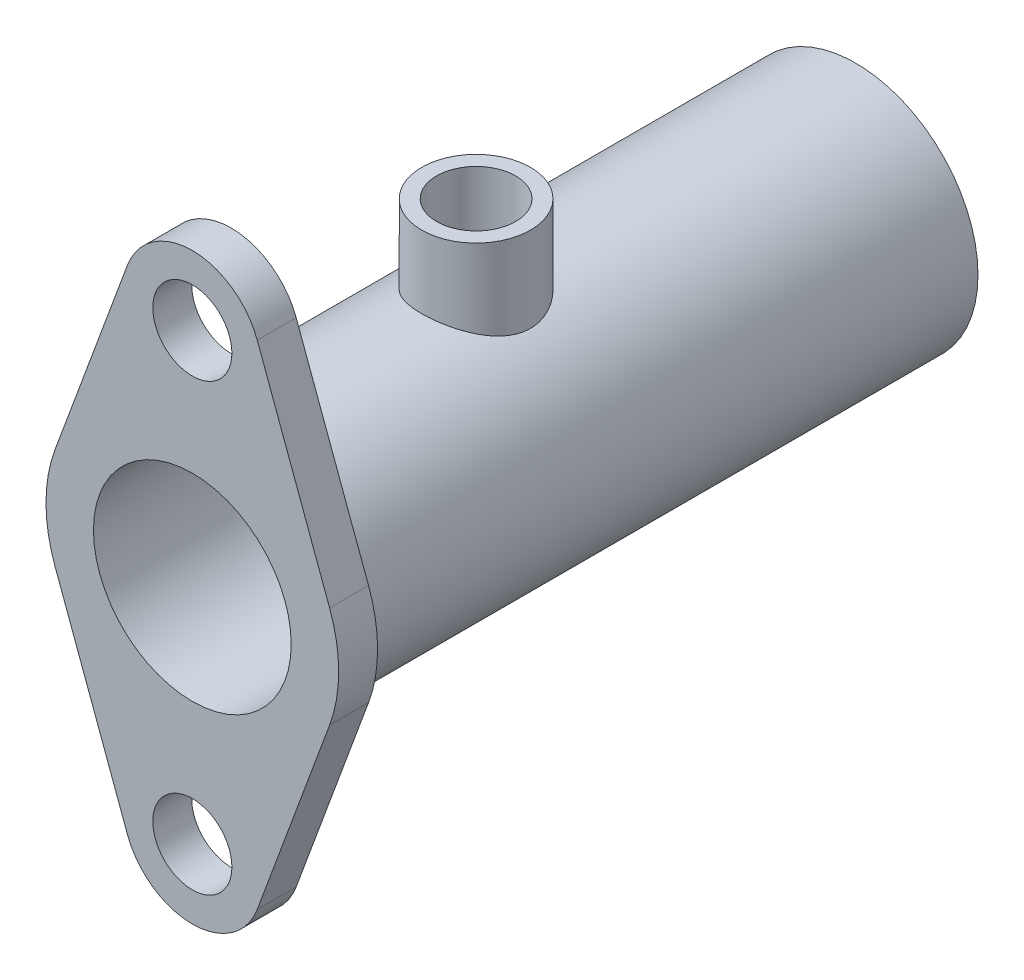
ISO-10303-21;
HEADER;
FILE_DESCRIPTION(('STEP AP214'),'2;1');
FILE_NAME('part.step','',(''),(''),'','','');
FILE_SCHEMA(('AUTOMOTIVE_DESIGN { 1 0 10303 214 1 1 1 1 }'));
ENDSEC;
DATA;
#1=APPLICATION_CONTEXT('core data for automotive mechanical design processes');
#2=APPLICATION_PROTOCOL_DEFINITION('international standard','automotive_design',2000,#1);
#3=PRODUCT_CONTEXT('',#1,'mechanical');
#4=PRODUCT('Part','Part','',(#3));
#5=PRODUCT_RELATED_PRODUCT_CATEGORY('part','',(#4));
#6=PRODUCT_DEFINITION_FORMATION('','',#4);
#7=PRODUCT_DEFINITION_CONTEXT('part definition',#1,'design');
#8=PRODUCT_DEFINITION('design','',#6,#7);
#9=PRODUCT_DEFINITION_SHAPE('','',#8);
#10=(LENGTH_UNIT() NAMED_UNIT(*) SI_UNIT(.MILLI.,.METRE.));
#11=(NAMED_UNIT(*) PLANE_ANGLE_UNIT() SI_UNIT($,.RADIAN.));
#12=(NAMED_UNIT(*) SI_UNIT($,.STERADIAN.) SOLID_ANGLE_UNIT());
#13=UNCERTAINTY_MEASURE_WITH_UNIT(LENGTH_MEASURE(1.E-05),#10,'distance_accuracy_value','');
#14=(GEOMETRIC_REPRESENTATION_CONTEXT(3) GLOBAL_UNCERTAINTY_ASSIGNED_CONTEXT((#13)) GLOBAL_UNIT_ASSIGNED_CONTEXT((#10,
#11,#12)) REPRESENTATION_CONTEXT('',''));
#15=CARTESIAN_POINT('',(0.,0.,0.));
#16=DIRECTION('',(0.,0.,1.));
#17=DIRECTION('',(1.,0.,0.));
#18=AXIS2_PLACEMENT_3D('',#15,#16,#17);
#19=CARTESIAN_POINT('',(0.,0.,0.));
#20=DIRECTION('',(0.,0.,1.));
#21=DIRECTION('',(1.,0.,0.));
#22=AXIS2_PLACEMENT_3D('',#19,#20,#21);
#23=PLANE('',#22);
#24=CARTESIAN_POINT('',(0.,-28.575,0.));
#25=DIRECTION('',(0.,0.,1.));
#26=DIRECTION('',(1.,0.,0.));
#27=AXIS2_PLACEMENT_3D('',#24,#25,#26);
#28=CIRCLE('',#27,5.08);
#29=CARTESIAN_POINT('',(5.08,-28.575,0.));
#30=VERTEX_POINT('',#29);
#31=EDGE_CURVE('E169',#30,#30,#28,.T.);
#32=ORIENTED_EDGE('',*,*,#31,.T.);
#33=EDGE_LOOP('',(#32));
#34=FACE_BOUND('',#33,.T.);
#35=CARTESIAN_POINT('',(0.,28.575,0.));
#36=DIRECTION('',(0.,0.,1.));
#37=DIRECTION('',(1.,0.,0.));
#38=AXIS2_PLACEMENT_3D('',#35,#36,#37);
#39=CIRCLE('',#38,5.08);
#40=CARTESIAN_POINT('',(5.08,28.575,0.));
#41=VERTEX_POINT('',#40);
#42=EDGE_CURVE('E166',#41,#41,#39,.T.);
#43=ORIENTED_EDGE('',*,*,#42,.T.);
#44=EDGE_LOOP('',(#43));
#45=FACE_BOUND('',#44,.T.);
#46=DIRECTION('',(0.346666666666667,-0.937988391304616,0.));
#47=VECTOR('',#46,1.);
#48=CARTESIAN_POINT('',(17.6304298029616,6.51594666666668,0.));
#49=LINE('',#48,#47);
#50=CARTESIAN_POINT('',(8.33871679869803,31.6568666666667,0.));
#51=VERTEX_POINT('',#50);
#52=CARTESIAN_POINT('',(17.6304298029616,6.51594666666668,0.));
#53=VERTEX_POINT('',#52);
#54=EDGE_CURVE('E149',#51,#53,#49,.T.);
#55=ORIENTED_EDGE('',*,*,#54,.T.);
#56=CARTESIAN_POINT('',(0.,0.,0.));
#57=DIRECTION('',(0.,0.,1.));
#58=DIRECTION('',(1.,0.,0.));
#59=AXIS2_PLACEMENT_3D('',#56,#57,#58);
#60=CIRCLE('',#59,18.796);
#61=CARTESIAN_POINT('',(17.6304298029616,-6.51594666666668,0.));
#62=VERTEX_POINT('',#61);
#63=EDGE_CURVE('E161',#62,#53,#60,.T.);
#64=ORIENTED_EDGE('',*,*,#63,.F.);
#65=DIRECTION('',(0.346666666666667,0.937988391304616,0.));
#66=VECTOR('',#65,1.);
#67=CARTESIAN_POINT('',(17.6304298029616,-6.51594666666668,0.));
#68=LINE('',#67,#66);
#69=CARTESIAN_POINT('',(8.33871679869803,-31.6568666666667,0.));
#70=VERTEX_POINT('',#69);
#71=EDGE_CURVE('E90',#70,#62,#68,.T.);
#72=ORIENTED_EDGE('',*,*,#71,.F.);
#73=CARTESIAN_POINT('',(0.,-28.575,0.));
#74=DIRECTION('',(0.,0.,1.));
#75=DIRECTION('',(1.,0.,0.));
#76=AXIS2_PLACEMENT_3D('',#73,#74,#75);
#77=CIRCLE('',#76,8.89);
#78=CARTESIAN_POINT('',(-8.33871679869803,-31.6568666666667,0.));
#79=VERTEX_POINT('',#78);
#80=EDGE_CURVE('E130',#79,#70,#77,.T.);
#81=ORIENTED_EDGE('',*,*,#80,.F.);
#82=DIRECTION('',(-0.346666666666667,0.937988391304616,0.));
#83=VECTOR('',#82,1.);
#84=CARTESIAN_POINT('',(-17.6304298029616,-6.51594666666668,0.));
#85=LINE('',#84,#83);
#86=CARTESIAN_POINT('',(-17.6304298029616,-6.51594666666667,0.));
#87=VERTEX_POINT('',#86);
#88=EDGE_CURVE('E160',#79,#87,#85,.T.);
#89=ORIENTED_EDGE('',*,*,#88,.T.);
#90=CARTESIAN_POINT('',(-17.6304298029616,6.51594666666667,0.));
#91=VERTEX_POINT('',#90);
#92=EDGE_CURVE('E157',#91,#87,#60,.T.);
#93=ORIENTED_EDGE('',*,*,#92,.F.);
#94=DIRECTION('',(-0.346666666666667,-0.937988391304616,0.));
#95=VECTOR('',#94,1.);
#96=CARTESIAN_POINT('',(-17.6304298029616,6.51594666666668,0.));
#97=LINE('',#96,#95);
#98=CARTESIAN_POINT('',(-8.33871679869803,31.6568666666667,0.));
#99=VERTEX_POINT('',#98);
#100=EDGE_CURVE('E155',#99,#91,#97,.T.);
#101=ORIENTED_EDGE('',*,*,#100,.F.);
#102=CARTESIAN_POINT('',(0.,28.575,0.));
#103=DIRECTION('',(0.,0.,1.));
#104=DIRECTION('',(1.,0.,0.));
#105=AXIS2_PLACEMENT_3D('',#102,#103,#104);
#106=CIRCLE('',#105,8.89);
#107=EDGE_CURVE('E152',#51,#99,#106,.T.);
#108=ORIENTED_EDGE('',*,*,#107,.F.);
#109=EDGE_LOOP('',(#55,#64,#72,#81,#89,#93,#101,#108));
#110=FACE_BOUND('',#109,.T.);
#111=CARTESIAN_POINT('',(0.,0.,0.));
#112=DIRECTION('',(0.,0.,1.));
#113=DIRECTION('',(1.,0.,0.));
#114=AXIS2_PLACEMENT_3D('',#111,#112,#113);
#115=CIRCLE('',#114,15.7);
#116=CARTESIAN_POINT('',(15.7,0.,0.));
#117=VERTEX_POINT('',#116);
#118=EDGE_CURVE('E13',#117,#117,#115,.F.);
#119=ORIENTED_EDGE('',*,*,#118,.F.);
#120=EDGE_LOOP('',(#119));
#121=FACE_BOUND('',#120,.T.);
#122=ADVANCED_FACE('F44',(#34,#45,#110,#121),#23,.F.);
#123=CARTESIAN_POINT('',(17.6304298029616,6.51594666666668,5.));
#124=DIRECTION('',(0.937988391304616,0.346666666666667,0.));
#125=DIRECTION('',(-0.346666666666667,0.937988391304616,0.));
#126=AXIS2_PLACEMENT_3D('',#123,#124,#125);
#127=PLANE('',#126);
#128=ORIENTED_EDGE('',*,*,#54,.F.);
#129=DIRECTION('',(0.,0.,-1.));
#130=VECTOR('',#129,1.);
#131=CARTESIAN_POINT('',(8.33871679869803,31.6568666666667,5.));
#132=LINE('',#131,#130);
#133=CARTESIAN_POINT('',(8.33871679869803,31.6568666666667,5.));
#134=VERTEX_POINT('',#133);
#135=EDGE_CURVE('E53',#134,#51,#132,.T.);
#136=ORIENTED_EDGE('',*,*,#135,.F.);
#137=DIRECTION('',(0.346666666666667,-0.937988391304616,0.));
#138=VECTOR('',#137,1.);
#139=CARTESIAN_POINT('',(17.6304298029616,6.51594666666668,5.));
#140=LINE('',#139,#138);
#141=CARTESIAN_POINT('',(17.6304298029616,6.51594666666668,5.));
#142=VERTEX_POINT('',#141);
#143=EDGE_CURVE('E172',#134,#142,#140,.T.);
#144=ORIENTED_EDGE('',*,*,#143,.T.);
#145=DIRECTION('',(0.,0.,-1.));
#146=VECTOR('',#145,1.);
#147=CARTESIAN_POINT('',(17.6304298029616,6.51594666666668,5.));
#148=LINE('',#147,#146);
#149=EDGE_CURVE('E97',#142,#53,#148,.T.);
#150=ORIENTED_EDGE('',*,*,#149,.T.);
#151=EDGE_LOOP('',(#128,#136,#144,#150));
#152=FACE_BOUND('',#151,.T.);
#153=ADVANCED_FACE('F46',(#152),#127,.T.);
#154=CARTESIAN_POINT('',(0.,28.575,5.));
#155=DIRECTION('',(0.,0.,-1.));
#156=DIRECTION('',(-1.,0.,0.));
#157=AXIS2_PLACEMENT_3D('',#154,#155,#156);
#158=CYLINDRICAL_SURFACE('',#157,8.89);
#159=ORIENTED_EDGE('',*,*,#107,.T.);
#160=DIRECTION('',(0.,0.,-1.));
#161=VECTOR('',#160,1.);
#162=CARTESIAN_POINT('',(-8.33871679869803,31.6568666666667,5.));
#163=LINE('',#162,#161);
#164=CARTESIAN_POINT('',(-8.33871679869803,31.6568666666667,5.));
#165=VERTEX_POINT('',#164);
#166=EDGE_CURVE('E181',#165,#99,#163,.T.);
#167=ORIENTED_EDGE('',*,*,#166,.F.);
#168=CARTESIAN_POINT('',(0.,28.575,5.));
#169=DIRECTION('',(0.,0.,1.));
#170=DIRECTION('',(1.,0.,0.));
#171=AXIS2_PLACEMENT_3D('',#168,#169,#170);
#172=CIRCLE('',#171,8.89);
#173=EDGE_CURVE('E187',#134,#165,#172,.T.);
#174=ORIENTED_EDGE('',*,*,#173,.F.);
#175=ORIENTED_EDGE('',*,*,#135,.T.);
#176=EDGE_LOOP('',(#159,#167,#174,#175));
#177=FACE_BOUND('',#176,.T.);
#178=ADVANCED_FACE('F185',(#177),#158,.T.);
#179=CARTESIAN_POINT('',(-17.6304298029616,6.51594666666668,5.));
#180=DIRECTION('',(0.937988391304616,-0.346666666666667,0.));
#181=DIRECTION('',(0.346666666666667,0.937988391304616,0.));
#182=AXIS2_PLACEMENT_3D('',#179,#180,#181);
#183=PLANE('',#182);
#184=ORIENTED_EDGE('',*,*,#100,.T.);
#185=DIRECTION('',(0.,0.,-1.));
#186=VECTOR('',#185,1.);
#187=CARTESIAN_POINT('',(-17.6304298029616,6.51594666666667,5.));
#188=LINE('',#187,#186);
#189=CARTESIAN_POINT('',(-17.6304298029616,6.51594666666667,5.));
#190=VERTEX_POINT('',#189);
#191=EDGE_CURVE('E178',#190,#91,#188,.T.);
#192=ORIENTED_EDGE('',*,*,#191,.F.);
#193=DIRECTION('',(-0.346666666666667,-0.937988391304616,0.));
#194=VECTOR('',#193,1.);
#195=CARTESIAN_POINT('',(-17.6304298029616,6.51594666666668,5.));
#196=LINE('',#195,#194);
#197=EDGE_CURVE('E243',#165,#190,#196,.T.);
#198=ORIENTED_EDGE('',*,*,#197,.F.);
#199=ORIENTED_EDGE('',*,*,#166,.T.);
#200=EDGE_LOOP('',(#184,#192,#198,#199));
#201=FACE_BOUND('',#200,.T.);
#202=ADVANCED_FACE('F198',(#201),#183,.F.);
#203=CARTESIAN_POINT('',(0.,0.,5.));
#204=DIRECTION('',(0.,0.,-1.));
#205=DIRECTION('',(-1.,0.,0.));
#206=AXIS2_PLACEMENT_3D('',#203,#204,#205);
#207=CYLINDRICAL_SURFACE('',#206,18.796);
#208=ORIENTED_EDGE('',*,*,#92,.T.);
#209=DIRECTION('',(0.,0.,-1.));
#210=VECTOR('',#209,1.);
#211=CARTESIAN_POINT('',(-17.6304298029616,-6.51594666666667,5.));
#212=LINE('',#211,#210);
#213=CARTESIAN_POINT('',(-17.6304298029616,-6.51594666666667,5.));
#214=VERTEX_POINT('',#213);
#215=EDGE_CURVE('E176',#214,#87,#212,.T.);
#216=ORIENTED_EDGE('',*,*,#215,.F.);
#217=CARTESIAN_POINT('',(0.,0.,5.));
#218=DIRECTION('',(0.,0.,1.));
#219=DIRECTION('',(1.,0.,0.));
#220=AXIS2_PLACEMENT_3D('',#217,#218,#219);
#221=CIRCLE('',#220,18.796);
#222=EDGE_CURVE('E138',#190,#214,#221,.T.);
#223=ORIENTED_EDGE('',*,*,#222,.F.);
#224=ORIENTED_EDGE('',*,*,#191,.T.);
#225=EDGE_LOOP('',(#208,#216,#223,#224));
#226=FACE_BOUND('',#225,.T.);
#227=ADVANCED_FACE('F223',(#226),#207,.T.);
#228=CARTESIAN_POINT('',(-17.6304298029616,-6.51594666666668,5.));
#229=DIRECTION('',(-0.937988391304616,-0.346666666666667,0.));
#230=DIRECTION('',(0.346666666666667,-0.937988391304616,0.));
#231=AXIS2_PLACEMENT_3D('',#228,#229,#230);
#232=PLANE('',#231);
#233=ORIENTED_EDGE('',*,*,#88,.F.);
#234=DIRECTION('',(0.,0.,-1.));
#235=VECTOR('',#234,1.);
#236=CARTESIAN_POINT('',(-8.33871679869803,-31.6568666666667,5.));
#237=LINE('',#236,#235);
#238=CARTESIAN_POINT('',(-8.33871679869803,-31.6568666666667,5.));
#239=VERTEX_POINT('',#238);
#240=EDGE_CURVE('E131',#239,#79,#237,.T.);
#241=ORIENTED_EDGE('',*,*,#240,.F.);
#242=DIRECTION('',(-0.346666666666667,0.937988391304616,0.));
#243=VECTOR('',#242,1.);
#244=CARTESIAN_POINT('',(-17.6304298029616,-6.51594666666668,5.));
#245=LINE('',#244,#243);
#246=EDGE_CURVE('E124',#239,#214,#245,.T.);
#247=ORIENTED_EDGE('',*,*,#246,.T.);
#248=ORIENTED_EDGE('',*,*,#215,.T.);
#249=EDGE_LOOP('',(#233,#241,#247,#248));
#250=FACE_BOUND('',#249,.T.);
#251=ADVANCED_FACE('F228',(#250),#232,.T.);
#252=CARTESIAN_POINT('',(0.,-28.575,5.));
#253=DIRECTION('',(0.,0.,-1.));
#254=DIRECTION('',(-1.,0.,0.));
#255=AXIS2_PLACEMENT_3D('',#252,#253,#254);
#256=CYLINDRICAL_SURFACE('',#255,8.89);
#257=ORIENTED_EDGE('',*,*,#80,.T.);
#258=DIRECTION('',(0.,0.,-1.));
#259=VECTOR('',#258,1.);
#260=CARTESIAN_POINT('',(8.33871679869803,-31.6568666666667,5.));
#261=LINE('',#260,#259);
#262=CARTESIAN_POINT('',(8.33871679869803,-31.6568666666667,5.));
#263=VERTEX_POINT('',#262);
#264=EDGE_CURVE('E127',#263,#70,#261,.T.);
#265=ORIENTED_EDGE('',*,*,#264,.F.);
#266=CARTESIAN_POINT('',(0.,-28.575,5.));
#267=DIRECTION('',(0.,0.,1.));
#268=DIRECTION('',(1.,0.,0.));
#269=AXIS2_PLACEMENT_3D('',#266,#267,#268);
#270=CIRCLE('',#269,8.89);
#271=EDGE_CURVE('E117',#239,#263,#270,.T.);
#272=ORIENTED_EDGE('',*,*,#271,.F.);
#273=ORIENTED_EDGE('',*,*,#240,.T.);
#274=EDGE_LOOP('',(#257,#265,#272,#273));
#275=FACE_BOUND('',#274,.T.);
#276=ADVANCED_FACE('F128',(#275),#256,.T.);
#277=CARTESIAN_POINT('',(17.6304298029616,-6.51594666666668,5.));
#278=DIRECTION('',(-0.937988391304616,0.346666666666667,0.));
#279=DIRECTION('',(-0.346666666666667,-0.937988391304616,0.));
#280=AXIS2_PLACEMENT_3D('',#277,#278,#279);
#281=PLANE('',#280);
#282=ORIENTED_EDGE('',*,*,#71,.T.);
#283=DIRECTION('',(0.,0.,-1.));
#284=VECTOR('',#283,1.);
#285=CARTESIAN_POINT('',(17.6304298029616,-6.51594666666668,5.));
#286=LINE('',#285,#284);
#287=CARTESIAN_POINT('',(17.6304298029616,-6.51594666666668,5.));
#288=VERTEX_POINT('',#287);
#289=EDGE_CURVE('E132',#288,#62,#286,.T.);
#290=ORIENTED_EDGE('',*,*,#289,.F.);
#291=DIRECTION('',(0.346666666666667,0.937988391304616,0.));
#292=VECTOR('',#291,1.);
#293=CARTESIAN_POINT('',(17.6304298029616,-6.51594666666668,5.));
#294=LINE('',#293,#292);
#295=EDGE_CURVE('E122',#263,#288,#294,.T.);
#296=ORIENTED_EDGE('',*,*,#295,.F.);
#297=ORIENTED_EDGE('',*,*,#264,.T.);
#298=EDGE_LOOP('',(#282,#290,#296,#297));
#299=FACE_BOUND('',#298,.T.);
#300=ADVANCED_FACE('F134',(#299),#281,.F.);
#301=CARTESIAN_POINT('',(0.,0.,5.));
#302=DIRECTION('',(0.,0.,-1.));
#303=DIRECTION('',(-1.,0.,0.));
#304=AXIS2_PLACEMENT_3D('',#301,#302,#303);
#305=CYLINDRICAL_SURFACE('',#304,12.7);
#306=CARTESIAN_POINT('',(0.,12.7,-26.368));
#307=CARTESIAN_POINT('',(0.13657888953433,12.6999993890941,-26.3680007849277));
#308=CARTESIAN_POINT('',(0.27321049045083,12.6977906501342,-26.3735156334634));
#309=CARTESIAN_POINT('',(0.545506981528575,12.6890110729112,-26.3955252117852));
#310=CARTESIAN_POINT('',(0.681171164826471,12.6824373212499,-26.4120272749339));
#311=CARTESIAN_POINT('',(0.950764736195462,12.6650829778938,-26.4558928846592));
#312=CARTESIAN_POINT('',(1.08468976587268,12.6542933692188,-26.4832797140166));
#313=CARTESIAN_POINT('',(1.34959558749273,12.6287890145993,-26.5486514081971));
#314=CARTESIAN_POINT('',(1.48057515260813,12.6140726647821,-26.5866406038356));
#315=CARTESIAN_POINT('',(1.73818399513655,12.5811568408139,-26.6727007503007));
#316=CARTESIAN_POINT('',(1.86482760981798,12.5629704921612,-26.7207337733429));
#317=CARTESIAN_POINT('',(2.11349766338329,12.5235383930419,-26.8265482374987));
#318=CARTESIAN_POINT('',(2.2355223567497,12.5022915002698,-26.8843333198205));
#319=CARTESIAN_POINT('',(2.59337709200364,12.434753871576,-27.0715729524004));
#320=CARTESIAN_POINT('',(2.82134541429832,12.3846183081885,-27.2150323049822));
#321=CARTESIAN_POINT('',(3.26012849529021,12.2766018463711,-27.5420844432643));
#322=CARTESIAN_POINT('',(3.46978650866248,12.2184808209976,-27.7271359157959));
#323=CARTESIAN_POINT('',(3.85617618145696,12.1020921712612,-28.1292710169515));
#324=CARTESIAN_POINT('',(4.03289173184128,12.0438244892236,-28.3463702245927));
#325=CARTESIAN_POINT('',(4.27333224607312,11.9597786559769,-28.6972877548414));
#326=CARTESIAN_POINT('',(4.35073758934107,11.9317639998504,-28.8214163937355));
#327=CARTESIAN_POINT('',(4.49474851386404,11.8782627873434,-29.076286333904));
#328=CARTESIAN_POINT('',(4.56135853651275,11.8527751929674,-29.2070248865447));
#329=CARTESIAN_POINT('',(4.68321059318658,11.8051609312419,-29.4742934400009));
#330=CARTESIAN_POINT('',(4.73845185833348,11.7830344912364,-29.6108238317704));
#331=CARTESIAN_POINT('',(4.83699721851358,11.7429251062006,-29.8886522114903));
#332=CARTESIAN_POINT('',(4.88030729315752,11.7249400863397,-30.0299477712587));
#333=CARTESIAN_POINT('',(4.95287304542164,11.694465704216,-30.3098424561225));
#334=CARTESIAN_POINT('',(4.98267257629154,11.6817657974293,-30.4482776755984));
#335=CARTESIAN_POINT('',(5.03063110741737,11.661193512457,-30.7274463742891));
#336=CARTESIAN_POINT('',(5.04879536472703,11.6533189541504,-30.8681787860691));
#337=CARTESIAN_POINT('',(5.07328409233394,11.6426787163624,-31.1508334912651));
#338=CARTESIAN_POINT('',(5.07961106381311,11.6399119576203,-31.2927555269498));
#339=CARTESIAN_POINT('',(5.08035408591595,11.6395877827342,-31.5766332631531));
#340=CARTESIAN_POINT('',(5.07477069207254,11.6420301236231,-31.7185889617927));
#341=CARTESIAN_POINT('',(5.05256941288101,11.6516811298172,-31.9914627151397));
#342=CARTESIAN_POINT('',(5.0367498788636,11.6585447995602,-32.1224588831577));
#343=CARTESIAN_POINT('',(4.99502856520063,11.6764808325947,-32.3825846999107));
#344=CARTESIAN_POINT('',(4.96912346727406,11.6875545810285,-32.5117137198128));
#345=CARTESIAN_POINT('',(4.90748707801188,11.7135685573434,-32.7671761518565));
#346=CARTESIAN_POINT('',(4.87175815242258,11.7285078542832,-32.8935102291642));
#347=CARTESIAN_POINT('',(4.7907983715432,11.7618093299808,-33.142649231893));
#348=CARTESIAN_POINT('',(4.74556386452582,11.7801728238946,-33.2654527803316));
#349=CARTESIAN_POINT('',(4.59413007330002,11.8404385283878,-33.6322981665486));
#350=CARTESIAN_POINT('',(4.47341172010527,11.8869773468941,-33.8697710990354));
#351=CARTESIAN_POINT('',(4.19735153484334,11.9872318445277,-34.3218369570536));
#352=CARTESIAN_POINT('',(4.0419966989154,12.040950216092,-34.5364212444604));
#353=CARTESIAN_POINT('',(3.68695363290425,12.1545765778349,-34.9542235641871));
#354=CARTESIAN_POINT('',(3.48476666911062,12.2146420372131,-35.1552806664471));
#355=CARTESIAN_POINT('',(3.04875312345319,12.3306858083655,-35.5213824852269));
#356=CARTESIAN_POINT('',(2.81492025526182,12.3866633046728,-35.6864200295496));
#357=CARTESIAN_POINT('',(2.44243576268607,12.4635923108057,-35.9047091173866));
#358=CARTESIAN_POINT('',(2.31322457349337,12.4882758300032,-35.9731341407114));
#359=CARTESIAN_POINT('',(2.04891683873549,12.5343483795847,-36.0987757501476));
#360=CARTESIAN_POINT('',(1.91382268754219,12.5557387345071,-36.1559968451037));
#361=CARTESIAN_POINT('',(1.63872263318651,12.5945976802382,-36.2586701700953));
#362=CARTESIAN_POINT('',(1.49871771000286,12.6120670484165,-36.3041247332222));
#363=CARTESIAN_POINT('',(1.21483842053292,12.6425684296083,-36.3828003061923));
#364=CARTESIAN_POINT('',(1.07096432289598,12.6556007498465,-36.4160221630511));
#365=CARTESIAN_POINT('',(0.789130156096128,12.6761998613456,-36.4682571984717));
#366=CARTESIAN_POINT('',(0.651324362804275,12.6840445945558,-36.4879952474239));
#367=CARTESIAN_POINT('',(0.37437855418075,12.6952369856342,-36.5160972297143));
#368=CARTESIAN_POINT('',(0.235238604913056,12.6985848650286,-36.5244617233426));
#369=CARTESIAN_POINT('',(-0.0432612075818106,12.7006896261756,-36.5297243686465));
#370=CARTESIAN_POINT('',(-0.182621015517081,12.6994475206655,-36.526625049705));
#371=CARTESIAN_POINT('',(-0.46049828676147,12.6924093937686,-36.5090000697498));
#372=CARTESIAN_POINT('',(-0.599015766169488,12.6866134596937,-36.4944746278126));
#373=CARTESIAN_POINT('',(-0.86791805955898,12.6709917787818,-36.4550692431393));
#374=CARTESIAN_POINT('',(-0.998387516609907,12.661359975826,-36.4306868846493));
#375=CARTESIAN_POINT('',(-1.25674613919475,12.6383311724186,-36.3718751929015));
#376=CARTESIAN_POINT('',(-1.38463444577234,12.6249329400146,-36.3374425721861));
#377=CARTESIAN_POINT('',(-1.63692767163367,12.59470548678,-36.2588544527936));
#378=CARTESIAN_POINT('',(-1.76133354706088,12.5778772184271,-36.2147016530158));
#379=CARTESIAN_POINT('',(-2.00599351119806,12.5411842059523,-36.1170201975302));
#380=CARTESIAN_POINT('',(-2.12624599962982,12.5213183070992,-36.0634879751756));
#381=CARTESIAN_POINT('',(-2.36544129119948,12.4783768512687,-35.9457090894106));
#382=CARTESIAN_POINT('',(-2.48423481013956,12.4552224678383,-35.8811876240042));
#383=CARTESIAN_POINT('',(-2.7160023907027,12.4067471458591,-35.7431073450562));
#384=CARTESIAN_POINT('',(-2.82897443924562,12.3814254658015,-35.6695454346768));
#385=CARTESIAN_POINT('',(-3.15821588246475,12.3031070234228,-35.4360329342036));
#386=CARTESIAN_POINT('',(-3.36495054910833,12.2477306510789,-35.2631862819227));
#387=CARTESIAN_POINT('',(-3.76109653179748,12.1321717181693,-34.8747309059985));
#388=CARTESIAN_POINT('',(-3.94846303887086,12.0719132209575,-34.6570523892458));
#389=CARTESIAN_POINT('',(-4.20038862869192,11.985601759733,-34.3087247660481));
#390=CARTESIAN_POINT('',(-4.2795508752071,11.957494069914,-34.1888973871397));
#391=CARTESIAN_POINT('',(-4.42762490615593,11.9034591784386,-33.942624548082));
#392=CARTESIAN_POINT('',(-4.49654099782848,11.8775310625448,-33.8161818992267));
#393=CARTESIAN_POINT('',(-4.62422692960089,11.8284089743566,-33.5561106185014));
#394=CARTESIAN_POINT('',(-4.68288588431906,11.8052456510456,-33.4224217555981));
#395=CARTESIAN_POINT('',(-4.78862218047476,11.7627524604073,-33.1500078965004));
#396=CARTESIAN_POINT('',(-4.83570455179987,11.7434209289223,-33.0112851176555));
#397=CARTESIAN_POINT('',(-4.9178049053994,11.709277279721,-32.7298252970664));
#398=CARTESIAN_POINT('',(-4.95282763062865,11.6944633855197,-32.5870898574119));
#399=CARTESIAN_POINT('',(-5.01042132280195,11.6699041491565,-32.2987016625336));
#400=CARTESIAN_POINT('',(-5.03299333215922,11.660158382679,-32.1530491525945));
#401=CARTESIAN_POINT('',(-5.06423356634903,11.6466219845978,-31.8706571953484));
#402=CARTESIAN_POINT('',(-5.07378780098628,11.6424522719262,-31.73403328421));
#403=CARTESIAN_POINT('',(-5.08182977776097,11.638944413022,-31.4603483423086));
#404=CARTESIAN_POINT('',(-5.08031380476877,11.6396078887934,-31.3232871802316));
#405=CARTESIAN_POINT('',(-5.06622654956677,11.6457462815635,-31.0499137743123));
#406=CARTESIAN_POINT('',(-5.0536608067671,11.6512187877246,-30.9136011896469));
#407=CARTESIAN_POINT('',(-5.01761817189203,11.6667858383301,-30.642645199244));
#408=CARTESIAN_POINT('',(-4.99413716774656,11.6768821246546,-30.5080024422184));
#409=CARTESIAN_POINT('',(-4.93766539459624,11.7008701114516,-30.246753056526));
#410=CARTESIAN_POINT('',(-4.90509278168097,11.7145937621218,-30.1200404582239));
#411=CARTESIAN_POINT('',(-4.83042520165497,11.7455786497197,-29.8698814951904));
#412=CARTESIAN_POINT('',(-4.78832692724271,11.7628411151246,-29.7464362815591));
#413=CARTESIAN_POINT('',(-4.64825084755525,11.8192196106272,-29.3821525345446));
#414=CARTESIAN_POINT('',(-4.53645102298801,11.8629449839448,-29.1471793379407));
#415=CARTESIAN_POINT('',(-4.27195397524239,11.9608258413198,-28.6854386958209));
#416=CARTESIAN_POINT('',(-4.11728162482376,12.0154351717205,-28.4599113964448));
#417=CARTESIAN_POINT('',(-3.77413630047471,12.1275870720341,-28.0367821512535));
#418=CARTESIAN_POINT('',(-3.58565313873735,12.1851305222992,-27.8391886545734));
#419=CARTESIAN_POINT('',(-3.27427857533985,12.2711761427216,-27.5612783039482));
#420=CARTESIAN_POINT('',(-3.161862586924,12.3006908493337,-27.469286628523));
#421=CARTESIAN_POINT('',(-2.92931746253446,12.3581316209862,-27.2951006393999));
#422=CARTESIAN_POINT('',(-2.80919113027475,12.3860582566084,-27.2129027950782));
#423=CARTESIAN_POINT('',(-2.5618316639536,12.4395759585663,-27.0588456909704));
#424=CARTESIAN_POINT('',(-2.43459197538871,12.4651648116434,-26.9869961919735));
#425=CARTESIAN_POINT('',(-2.173979065224,12.5132473271103,-26.8543545617671));
#426=CARTESIAN_POINT('',(-2.04060868857344,12.5357424062024,-26.7935573653503));
#427=CARTESIAN_POINT('',(-1.77107599138872,12.5766263814249,-26.6845518440859));
#428=CARTESIAN_POINT('',(-1.63500812768193,12.5950823287861,-26.6361352662267));
#429=CARTESIAN_POINT('',(-1.35884261395213,12.6278607537935,-26.5509792289659));
#430=CARTESIAN_POINT('',(-1.21874689081949,12.6421851728988,-26.5142342840872));
#431=CARTESIAN_POINT('',(-0.935917858309417,12.6662604532646,-26.4528674921762));
#432=CARTESIAN_POINT('',(-0.793192120404746,12.6760227961443,-26.4282152030541));
#433=CARTESIAN_POINT('',(-0.505983414523336,12.6907299121793,-26.3911909795778));
#434=CARTESIAN_POINT('',(-0.36150186108248,12.6956783327828,-26.3788097474647));
#435=CARTESIAN_POINT('',(-0.180670557752245,12.6987663598475,-26.3710849206923));
#436=CARTESIAN_POINT('',(-0.144548710117646,12.6992287733608,-26.3699283332516));
#437=CARTESIAN_POINT('',(-0.0722858055529835,12.6998456742016,-26.3683857692217));
#438=CARTESIAN_POINT('',(-0.0361447486318708,12.7000001616724,-26.3679997922738));
#439=CARTESIAN_POINT('',(0.,12.7,-26.368));
#440=B_SPLINE_CURVE_WITH_KNOTS('',3,(#306,#307,#308,#309,#310,#311,#312,#313,#314,#315,#316,
#317,#318,#319,#320,#321,#322,#323,#324,#325,#326,#327,#328,#329,#330,#331,#332,#333,#334,#335,
#336,#337,#338,#339,#340,#341,#342,#343,#344,#345,#346,#347,#348,#349,#350,#351,#352,#353,#354,
#355,#356,#357,#358,#359,#360,#361,#362,#363,#364,#365,#366,#367,#368,#369,#370,#371,#372,#373,
#374,#375,#376,#377,#378,#379,#380,#381,#382,#383,#384,#385,#386,#387,#388,#389,#390,#391,#392,
#393,#394,#395,#396,#397,#398,#399,#400,#401,#402,#403,#404,#405,#406,#407,#408,#409,#410,#411,
#412,#413,#414,#415,#416,#417,#418,#419,#420,#421,#422,#423,#424,#425,#426,#427,#428,#429,#430,
#431,#432,#433,#434,#435,#436,#437,#438,#439),.UNSPECIFIED.,.T.,.F.,(4,2,2,2,2,2,2,2,2,2,2,2,2,
2,2,2,2,2,2,2,2,2,2,2,2,2,2,2,2,2,2,2,2,2,2,2,2,2,2,2,2,2,2,2,2,2,2,2,2,2,2,2,2,2,2,2,2,2,2,2,2,
2,2,2,2,2,4),(0.,0.409699505849388,0.81967273811972,1.23052767394621,1.64155068053326,
2.05104872888448,2.46070001461612,3.2788748532651,4.13217840782839,4.98589814397235,
5.43226743317487,5.87845260906245,6.32466795090346,6.77065925237037,7.19662008757566,
7.62238832899001,8.04806659672581,8.47372501006495,8.86963855200047,9.26568246484387,
9.66163108692252,10.0577320982475,10.8652829099338,11.6731374191737,12.5434411712824,
13.4139180600731,13.8582776241643,14.3024579935235,14.7465502223361,15.1906116955894,
15.6083783642092,16.0261244518428,16.4437783732157,16.8614242869822,17.2601967308736,
17.6590997603512,18.0578921700232,18.4568365560964,18.8678316973273,19.2789680209496,
20.1007709519075,20.9768300360938,21.4154180400381,21.8538211475581,22.296704450852,
22.7393949852361,23.181911213857,23.6243903879972,24.0349300132417,24.4456074207264,
24.8560790669549,25.2667054742761,25.6608997623927,26.0552311250107,26.8433249833231,
27.6765423225119,28.5100111481212,28.9542450447566,29.3983183097817,29.842807729363,
30.2870929255824,30.7233232046688,31.1593481582451,31.594269754901,32.0288615596941,
32.1372860211734,32.2457104321788),.UNSPECIFIED.);
#441=CARTESIAN_POINT('',(0.,12.7,-26.368));
#442=VERTEX_POINT('',#441);
#443=EDGE_CURVE('E289',#442,#442,#440,.T.);
#444=ORIENTED_EDGE('',*,*,#443,.T.);
#445=EDGE_LOOP('',(#444));
#446=FACE_BOUND('',#445,.T.);
#447=CARTESIAN_POINT('',(0.,0.,5.));
#448=DIRECTION('',(0.,0.,1.));
#449=DIRECTION('',(1.,0.,0.));
#450=AXIS2_PLACEMENT_3D('',#447,#448,#449);
#451=CIRCLE('',#450,12.7);
#452=CARTESIAN_POINT('',(12.7,0.,5.));
#453=VERTEX_POINT('',#452);
#454=EDGE_CURVE('E143',#453,#453,#451,.T.);
#455=ORIENTED_EDGE('',*,*,#454,.T.);
#456=EDGE_LOOP('',(#455));
#457=FACE_BOUND('',#456,.T.);
#458=CARTESIAN_POINT('',(0.,0.,-77.216));
#459=DIRECTION('',(0.,0.,-1.));
#460=DIRECTION('',(-1.,0.,0.));
#461=AXIS2_PLACEMENT_3D('',#458,#459,#460);
#462=CIRCLE('',#461,12.7);
#463=CARTESIAN_POINT('',(-12.7,0.,-77.216));
#464=VERTEX_POINT('',#463);
#465=EDGE_CURVE('E153',#464,#464,#462,.T.);
#466=ORIENTED_EDGE('',*,*,#465,.T.);
#467=EDGE_LOOP('',(#466));
#468=FACE_BOUND('',#467,.T.);
#469=ADVANCED_FACE('F212',(#446,#457,#468),#305,.F.);
#470=CARTESIAN_POINT('',(0.,28.575,5.));
#471=DIRECTION('',(0.,0.,-1.));
#472=DIRECTION('',(-1.,0.,0.));
#473=AXIS2_PLACEMENT_3D('',#470,#471,#472);
#474=CYLINDRICAL_SURFACE('',#473,5.08);
#475=CARTESIAN_POINT('',(0.,28.575,5.));
#476=DIRECTION('',(0.,0.,1.));
#477=DIRECTION('',(1.,0.,0.));
#478=AXIS2_PLACEMENT_3D('',#475,#476,#477);
#479=CIRCLE('',#478,5.08);
#480=CARTESIAN_POINT('',(5.08,28.575,5.));
#481=VERTEX_POINT('',#480);
#482=EDGE_CURVE('E136',#481,#481,#479,.T.);
#483=ORIENTED_EDGE('',*,*,#482,.T.);
#484=EDGE_LOOP('',(#483));
#485=FACE_BOUND('',#484,.T.);
#486=ORIENTED_EDGE('',*,*,#42,.F.);
#487=EDGE_LOOP('',(#486));
#488=FACE_BOUND('',#487,.T.);
#489=ADVANCED_FACE('F215',(#485,#488),#474,.F.);
#490=ORIENTED_EDGE('',*,*,#63,.T.);
#491=ORIENTED_EDGE('',*,*,#149,.F.);
#492=EDGE_CURVE('E61',#288,#142,#221,.T.);
#493=ORIENTED_EDGE('',*,*,#492,.F.);
#494=ORIENTED_EDGE('',*,*,#289,.T.);
#495=EDGE_LOOP('',(#490,#491,#493,#494));
#496=FACE_BOUND('',#495,.T.);
#497=ADVANCED_FACE('F210',(#496),#207,.T.);
#498=CARTESIAN_POINT('',(0.,-28.575,5.));
#499=DIRECTION('',(0.,0.,-1.));
#500=DIRECTION('',(-1.,0.,0.));
#501=AXIS2_PLACEMENT_3D('',#498,#499,#500);
#502=CYLINDRICAL_SURFACE('',#501,5.08);
#503=CARTESIAN_POINT('',(0.,-28.575,5.));
#504=DIRECTION('',(0.,0.,1.));
#505=DIRECTION('',(1.,0.,0.));
#506=AXIS2_PLACEMENT_3D('',#503,#504,#505);
#507=CIRCLE('',#506,5.08);
#508=CARTESIAN_POINT('',(5.08,-28.575,5.));
#509=VERTEX_POINT('',#508);
#510=EDGE_CURVE('E146',#509,#509,#507,.T.);
#511=ORIENTED_EDGE('',*,*,#510,.T.);
#512=EDGE_LOOP('',(#511));
#513=FACE_BOUND('',#512,.T.);
#514=ORIENTED_EDGE('',*,*,#31,.F.);
#515=EDGE_LOOP('',(#514));
#516=FACE_BOUND('',#515,.T.);
#517=ADVANCED_FACE('F207',(#513,#516),#502,.F.);
#518=CARTESIAN_POINT('',(0.,0.,5.));
#519=DIRECTION('',(0.,0.,1.));
#520=DIRECTION('',(1.,0.,0.));
#521=AXIS2_PLACEMENT_3D('',#518,#519,#520);
#522=PLANE('',#521);
#523=ORIENTED_EDGE('',*,*,#143,.F.);
#524=ORIENTED_EDGE('',*,*,#173,.T.);
#525=ORIENTED_EDGE('',*,*,#197,.T.);
#526=ORIENTED_EDGE('',*,*,#222,.T.);
#527=ORIENTED_EDGE('',*,*,#246,.F.);
#528=ORIENTED_EDGE('',*,*,#271,.T.);
#529=ORIENTED_EDGE('',*,*,#295,.T.);
#530=ORIENTED_EDGE('',*,*,#492,.T.);
#531=EDGE_LOOP('',(#523,#524,#525,#526,#527,#528,#529,#530));
#532=FACE_BOUND('',#531,.T.);
#533=ORIENTED_EDGE('',*,*,#482,.F.);
#534=EDGE_LOOP('',(#533));
#535=FACE_BOUND('',#534,.T.);
#536=ORIENTED_EDGE('',*,*,#454,.F.);
#537=EDGE_LOOP('',(#536));
#538=FACE_BOUND('',#537,.T.);
#539=ORIENTED_EDGE('',*,*,#510,.F.);
#540=EDGE_LOOP('',(#539));
#541=FACE_BOUND('',#540,.T.);
#542=ADVANCED_FACE('F119',(#532,#535,#538,#541),#522,.T.);
#543=CARTESIAN_POINT('',(0.,0.,-77.216));
#544=DIRECTION('',(0.,0.,1.));
#545=DIRECTION('',(1.,0.,0.));
#546=AXIS2_PLACEMENT_3D('',#543,#544,#545);
#547=CYLINDRICAL_SURFACE('',#546,15.7);
#548=CARTESIAN_POINT('',(0.,15.7,-24.463));
#549=CARTESIAN_POINT('',(0.186032779317529,15.6999988410052,-24.4630013861049));
#550=CARTESIAN_POINT('',(0.372112687911731,15.6966847889188,-24.4704416552342));
#551=CARTESIAN_POINT('',(0.742932856923946,15.6835107723961,-24.5001293222759));
#552=CARTESIAN_POINT('',(0.927672292771149,15.6736470756997,-24.5223851627359));
#553=CARTESIAN_POINT('',(1.29470305092912,15.6476084549089,-24.5815175367788));
#554=CARTESIAN_POINT('',(1.47698914345258,15.6314217517207,-24.6184213600877));
#555=CARTESIAN_POINT('',(1.83752582596452,15.5931517526312,-24.7064736544273));
#556=CARTESIAN_POINT('',(2.01577473267423,15.5710660445465,-24.75762795304));
#557=CARTESIAN_POINT('',(2.36626968807052,15.5216611948188,-24.873433779472));
#558=CARTESIAN_POINT('',(2.53853697922673,15.4943634384925,-24.9380302474602));
#559=CARTESIAN_POINT('',(2.87683117369774,15.4351336117232,-25.0802879822115));
#560=CARTESIAN_POINT('',(3.04285567865691,15.4031997826382,-25.1579542086275));
#561=CARTESIAN_POINT('',(3.36757122851222,15.3354798719132,-25.3256597639584));
#562=CARTESIAN_POINT('',(3.52626708645025,15.2996963714609,-25.4156908133791));
#563=CARTESIAN_POINT('',(3.83565130858797,15.2250830311892,-25.6075227583963));
#564=CARTESIAN_POINT('',(3.98633672881905,15.1862520841894,-25.7093279381236));
#565=CARTESIAN_POINT('',(4.44001033072333,15.062454565206,-26.0422869960045));
#566=CARTESIAN_POINT('',(4.72824664552209,14.9737145049949,-26.2925636458978));
#567=CARTESIAN_POINT('',(5.26022397541724,14.7952366851409,-26.8365865673911));
#568=CARTESIAN_POINT('',(5.50393841259227,14.7054983632596,-27.1303586159432));
#569=CARTESIAN_POINT('',(5.83819657801715,14.5746674980289,-27.6078883924871));
#570=CARTESIAN_POINT('',(5.94686015937166,14.5305505551137,-27.7783845580533));
#571=CARTESIAN_POINT('',(6.14932526897757,14.446031336027,-28.1288245511044));
#572=CARTESIAN_POINT('',(6.24313293595409,14.4056275284344,-28.3087644351401));
#573=CARTESIAN_POINT('',(6.41505195552821,14.3298967448669,-28.6769686290873));
#574=CARTESIAN_POINT('',(6.49316684125846,14.2945686266433,-28.8652310535587));
#575=CARTESIAN_POINT('',(6.63291351556871,14.2302629147987,-29.2488326787076));
#576=CARTESIAN_POINT('',(6.69454672591926,14.2012847734442,-29.4441712673172));
#577=CARTESIAN_POINT('',(6.79779454549944,14.1521407033937,-29.8299862095799));
#578=CARTESIAN_POINT('',(6.84029202586688,14.1315912502913,-30.0201773782015));
#579=CARTESIAN_POINT('',(6.90930677664957,14.0979771625158,-30.4040959438671));
#580=CARTESIAN_POINT('',(6.93582460098159,14.0849122683996,-30.597823218096));
#581=CARTESIAN_POINT('',(6.97251571691438,14.0667851866193,-30.9870819670836));
#582=CARTESIAN_POINT('',(6.98269839825358,14.061718401523,-31.1826123403261));
#583=CARTESIAN_POINT('',(6.9866049276652,14.0597780843154,-31.5738721074798));
#584=CARTESIAN_POINT('',(6.98032983668044,14.0629040240639,-31.7696014877488));
#585=CARTESIAN_POINT('',(6.95271822667685,14.076573161843,-32.141967067274));
#586=CARTESIAN_POINT('',(6.93278892351773,14.0864230630972,-32.3187353880116));
#587=CARTESIAN_POINT('',(6.87959781044224,14.1124771410349,-32.6698402292057));
#588=CARTESIAN_POINT('',(6.84633147274554,14.1286834756188,-32.8441759029843));
#589=CARTESIAN_POINT('',(6.76682454670356,14.1669342626858,-33.1891610553161));
#590=CARTESIAN_POINT('',(6.72058667836674,14.1889774911727,-33.3598112985986));
#591=CARTESIAN_POINT('',(6.61555668193132,14.2382503067728,-33.6964988196947));
#592=CARTESIAN_POINT('',(6.55675968407359,14.2654819052149,-33.8625342798389));
#593=CARTESIAN_POINT('',(6.42569201283048,14.3250051533957,-34.1926190417771));
#594=CARTESIAN_POINT('',(6.35315288043158,14.3573951200687,-34.3565438632262));
#595=CARTESIAN_POINT('',(6.19603202184392,14.425897921028,-34.6777668403998));
#596=CARTESIAN_POINT('',(6.11144624877751,14.4620120052429,-34.8350627461401));
#597=CARTESIAN_POINT('',(5.93080444022064,14.5370258812596,-35.1422576352828));
#598=CARTESIAN_POINT('',(5.8347465295698,14.5759261280521,-35.2921554037597));
#599=CARTESIAN_POINT('',(5.63173153653869,14.6555617020351,-35.5838684533458));
#600=CARTESIAN_POINT('',(5.52477375686465,14.6962971465348,-35.7256832164575));
#601=CARTESIAN_POINT('',(5.2895304606494,14.7826946961286,-36.0140730730427));
#602=CARTESIAN_POINT('',(5.1601820900803,14.8284487292061,-36.1597552418787));
#603=CARTESIAN_POINT('',(4.88979210976776,14.9197952288097,-36.4397966121605));
#604=CARTESIAN_POINT('',(4.74875375022087,14.9653877365934,-36.5741589400796));
#605=CARTESIAN_POINT('',(4.45560468820493,15.0552682484168,-36.8309174109106));
#606=CARTESIAN_POINT('',(4.30348660269803,15.0995553544738,-36.953305445046));
#607=CARTESIAN_POINT('',(3.98913799879243,15.1856287662371,-37.1851710270373));
#608=CARTESIAN_POINT('',(3.82691155034334,15.2274160653312,-37.2946537203036));
#609=CARTESIAN_POINT('',(3.48813945210662,15.3086291146753,-37.5030673148558));
#610=CARTESIAN_POINT('',(3.31130921371523,15.3479453200778,-37.6015792975761));
#611=CARTESIAN_POINT('',(2.94900999994777,15.4216566168329,-37.7831877894486));
#612=CARTESIAN_POINT('',(2.76354485645978,15.45605386398,-37.8662910564274));
#613=CARTESIAN_POINT('',(2.38524686460598,15.5189351414719,-38.0162729167994));
#614=CARTESIAN_POINT('',(2.1924160527026,15.5474207924442,-38.0831559577176));
#615=CARTESIAN_POINT('',(1.8008283449865,15.5976269548805,-38.1999609530331));
#616=CARTESIAN_POINT('',(1.60207197351575,15.6193480629911,-38.2498844033368));
#617=CARTESIAN_POINT('',(1.21437924225977,15.6540879629447,-38.3292697733553));
#618=CARTESIAN_POINT('',(1.0257307243693,15.6676099032499,-38.3599203741943));
#619=CARTESIAN_POINT('',(0.646195881185299,15.6878467419095,-38.4056708752333));
#620=CARTESIAN_POINT('',(0.455309660347636,15.6945619567316,-38.4207714984051));
#621=CARTESIAN_POINT('',(0.072880608307775,15.7009952933601,-38.4352397853472));
#622=CARTESIAN_POINT('',(-0.118662014978167,15.7007154569285,-38.4346120400178));
#623=CARTESIAN_POINT('',(-0.500908079945251,15.6931714145263,-38.4176422173983));
#624=CARTESIAN_POINT('',(-0.691611545252796,15.6859074064748,-38.4013005854117));
#625=CARTESIAN_POINT('',(-1.05955320667115,15.6652256508734,-38.3545134910865));
#626=CARTESIAN_POINT('',(-1.23692616711731,15.652193008664,-38.3249496049938));
#627=CARTESIAN_POINT('',(-1.5884386460334,15.6204358171328,-38.2523593117716));
#628=CARTESIAN_POINT('',(-1.76257702505326,15.6017093009115,-38.2093282523729));
#629=CARTESIAN_POINT('',(-2.1063828076548,15.5590215927083,-38.1102349786374));
#630=CARTESIAN_POINT('',(-2.27605154223505,15.5350619792764,-38.0541766936036));
#631=CARTESIAN_POINT('',(-2.61002433152749,15.482453436429,-37.9294954661985));
#632=CARTESIAN_POINT('',(-2.77432631043522,15.4538027177136,-37.8608677283474));
#633=CARTESIAN_POINT('',(-3.1015635657346,15.3915201649996,-37.7093126440945));
#634=CARTESIAN_POINT('',(-3.26430087176848,15.3577620883712,-37.626009961815));
#635=CARTESIAN_POINT('',(-3.58222671562327,15.2867326864193,-37.4472623107936));
#636=CARTESIAN_POINT('',(-3.73741265410912,15.2494601641412,-37.3518132013074));
#637=CARTESIAN_POINT('',(-4.03943828809408,15.1722523029076,-37.1494222303958));
#638=CARTESIAN_POINT('',(-4.18627642935603,15.1323164710713,-37.0424782394373));
#639=CARTESIAN_POINT('',(-4.47089239893258,15.0506825164342,-36.817751230936));
#640=CARTESIAN_POINT('',(-4.60866970758685,15.008984292781,-36.6999675926416));
#641=CARTESIAN_POINT('',(-4.88529941336365,14.9213461033628,-36.4442354166906));
#642=CARTESIAN_POINT('',(-5.02333527279207,14.8753360986624,-36.3054263178654));
#643=CARTESIAN_POINT('',(-5.287274957185,14.7835802113612,-36.016719060141));
#644=CARTESIAN_POINT('',(-5.41318230340477,14.7378342557473,-35.8668241422504));
#645=CARTESIAN_POINT('',(-5.65226233674884,14.6478073899398,-35.556592520114));
#646=CARTESIAN_POINT('',(-5.7654254483756,14.603527598766,-35.3962481054665));
#647=CARTESIAN_POINT('',(-5.97811240924603,14.5177587496527,-35.0661393148244));
#648=CARTESIAN_POINT('',(-6.07764189390508,14.4762685422808,-34.8963788719285));
#649=CARTESIAN_POINT('',(-6.2645971940605,14.3963679934216,-34.544088783533));
#650=CARTESIAN_POINT('',(-6.35167091843195,14.3580567518305,-34.3613493018728));
#651=CARTESIAN_POINT('',(-6.50990815775084,14.2870088558962,-33.9881526629807));
#652=CARTESIAN_POINT('',(-6.58107913930442,14.2542695871457,-33.7976991774322));
#653=CARTESIAN_POINT('',(-6.70674199700559,14.1955776785652,-33.4104591530539));
#654=CARTESIAN_POINT('',(-6.76124339880918,14.1696211640413,-33.2136763023963));
#655=CARTESIAN_POINT('',(-6.85292553293867,14.125509235121,-32.8152623023089));
#656=CARTESIAN_POINT('',(-6.89010822788835,14.1073529367915,-32.6136317049694));
#657=CARTESIAN_POINT('',(-6.94423534729727,14.0807819105288,-32.2245680351705));
#658=CARTESIAN_POINT('',(-6.96263015596188,14.0716709135802,-32.0373831904211));
#659=CARTESIAN_POINT('',(-6.9842544691958,14.0609508848968,-31.6619282394325));
#660=CARTESIAN_POINT('',(-6.98748486964959,14.0593414099864,-31.4736581979626));
#661=CARTESIAN_POINT('',(-6.97874015750776,14.0636840049917,-31.0975980708393));
#662=CARTESIAN_POINT('',(-6.96676790771578,14.0696346512648,-30.9098079014933));
#663=CARTESIAN_POINT('',(-6.92777665663993,14.0888743887684,-30.5361812884815));
#664=CARTESIAN_POINT('',(-6.90075789309024,14.1021633640536,-30.3503448139947));
#665=CARTESIAN_POINT('',(-6.83409683861814,14.1345817051335,-29.9932457494799));
#666=CARTESIAN_POINT('',(-6.79532082604946,14.1533073712189,-29.8217834784449));
#667=CARTESIAN_POINT('',(-6.70516039283341,14.1962430108259,-29.4828509230112));
#668=CARTESIAN_POINT('',(-6.65377165905522,14.2204548602217,-29.3153820257529));
#669=CARTESIAN_POINT('',(-6.53886273302386,14.2736567740307,-28.9854794782118));
#670=CARTESIAN_POINT('',(-6.47534438338102,14.3026461126038,-28.8230450674905));
#671=CARTESIAN_POINT('',(-6.33664931240143,14.3646317061862,-28.5039588339129));
#672=CARTESIAN_POINT('',(-6.26146810983425,14.3976295003068,-28.3473092625352));
#673=CARTESIAN_POINT('',(-6.09483024227358,14.4689934760955,-28.0307989661703));
#674=CARTESIAN_POINT('',(-6.00264139674622,14.5075678152898,-27.8713705671549));
#675=CARTESIAN_POINT('',(-5.80627069119525,14.5872701340807,-27.5606830701124));
#676=CARTESIAN_POINT('',(-5.70208470774503,14.628398989416,-27.4094268072557));
#677=CARTESIAN_POINT('',(-5.4823385153971,14.7121646923756,-27.1158159290927));
#678=CARTESIAN_POINT('',(-5.36677620685311,14.7548018174366,-26.9734629649621));
#679=CARTESIAN_POINT('',(-5.12489974596246,14.8405480825405,-26.6983494989182));
#680=CARTESIAN_POINT('',(-4.99858497264541,14.8836572497191,-26.5655895518351));
#681=CARTESIAN_POINT('',(-4.7242437406573,14.9731133162771,-26.2990714945513));
#682=CARTESIAN_POINT('',(-4.57528485663302,15.0194111216722,-26.166254549258));
#683=CARTESIAN_POINT('',(-4.26625061302565,15.1100968488186,-25.9136393795788));
#684=CARTESIAN_POINT('',(-4.1061788781011,15.1544853857331,-25.7938369426696));
#685=CARTESIAN_POINT('',(-3.77562308536831,15.2402049060995,-25.5679488302579));
#686=CARTESIAN_POINT('',(-3.60512959710285,15.2815330431876,-25.4618758571256));
#687=CARTESIAN_POINT('',(-3.25496517476715,15.3599274268161,-25.2644898125705));
#688=CARTESIAN_POINT('',(-3.07529853593145,15.3969956420633,-25.1731699150871));
#689=CARTESIAN_POINT('',(-2.70984849800816,15.4654747361265,-25.0069746883104));
#690=CARTESIAN_POINT('',(-2.5241507580299,15.4969417284314,-24.931934381852));
#691=CARTESIAN_POINT('',(-2.14624065563946,15.5537820000573,-24.7978837851437));
#692=CARTESIAN_POINT('',(-1.95403148004927,15.5791582125275,-24.7388657772012));
#693=CARTESIAN_POINT('',(-1.56497550317069,15.6230306538005,-24.6376116698525));
#694=CARTESIAN_POINT('',(-1.36814098741699,15.6415433068507,-24.5953354911075));
#695=CARTESIAN_POINT('',(-0.971111760912159,15.6712000517643,-24.5279089156647));
#696=CARTESIAN_POINT('',(-0.770919481543908,15.6823492577985,-24.5027466324067));
#697=CARTESIAN_POINT('',(-0.475193263890028,15.693094156115,-24.4785332784508));
#698=CARTESIAN_POINT('',(-0.380272302618599,15.6956817515949,-24.4727106057566));
#699=CARTESIAN_POINT('',(-0.190238336615355,15.6991349800021,-24.4649435892954));
#700=CARTESIAN_POINT('',(-0.0951253296335507,15.7000005926362,-24.4629992912341));
#701=CARTESIAN_POINT('',(0.,15.7,-24.463));
#702=B_SPLINE_CURVE_WITH_KNOTS('',3,(#548,#549,#550,#551,#552,#553,#554,#555,#556,#557,#558,
#559,#560,#561,#562,#563,#564,#565,#566,#567,#568,#569,#570,#571,#572,#573,#574,#575,#576,#577,
#578,#579,#580,#581,#582,#583,#584,#585,#586,#587,#588,#589,#590,#591,#592,#593,#594,#595,#596,
#597,#598,#599,#600,#601,#602,#603,#604,#605,#606,#607,#608,#609,#610,#611,#612,#613,#614,#615,
#616,#617,#618,#619,#620,#621,#622,#623,#624,#625,#626,#627,#628,#629,#630,#631,#632,#633,#634,
#635,#636,#637,#638,#639,#640,#641,#642,#643,#644,#645,#646,#647,#648,#649,#650,#651,#652,#653,
#654,#655,#656,#657,#658,#659,#660,#661,#662,#663,#664,#665,#666,#667,#668,#669,#670,#671,#672,
#673,#674,#675,#676,#677,#678,#679,#680,#681,#682,#683,#684,#685,#686,#687,#688,#689,#690,#691,
#692,#693,#694,#695,#696,#697,#698,#699,#700,#701),.UNSPECIFIED.,.T.,.F.,(4,2,2,2,2,2,2,2,2,2,2,
2,2,2,2,2,2,2,2,2,2,2,2,2,2,2,2,2,2,2,2,2,2,2,2,2,2,2,2,2,2,2,2,2,2,2,2,2,2,2,2,2,2,2,2,2,2,2,2,
2,2,2,2,2,2,2,2,2,2,2,2,2,2,2,2,2,4),(0.,0.558002846952873,1.11632394034547,1.67569012561914,
2.23528539445382,2.79263212450239,3.35019083288402,3.90737800344557,4.46476855357522,
5.63515041249432,6.80622867929465,7.42637860215366,8.0462715957234,8.66602486741985,
9.28572465963773,9.87280914655351,10.4598732816764,11.0465998405433,11.6332885772791,
12.1671441983487,12.7011812113591,13.2351063254048,13.7692388441068,14.315146614627,
14.8612382086727,15.4074191857486,15.9536351254418,16.5533196733839,17.1528380452692,
17.7527596303186,18.3524412093611,18.9702472095945,19.587781613376,20.2051464996158,
20.8224569175649,21.3965098236641,21.9705360388707,22.5443947054563,23.118237110386,
23.658489060884,24.1989278491796,24.7392038401244,25.2796863874019,25.8368163848133,
26.3941368204532,26.9515606834065,27.5090164881155,28.1116173677257,28.7140427643636,
29.3169178207985,29.919542923938,30.5367833796924,31.1537334188155,31.7703302467972,
32.3868571825971,32.9510335306516,33.5151765478181,34.0792133472409,34.6432412351626,
35.173015612086,35.7029714072476,36.2328467607575,36.7629262154282,37.3268109887108,
37.8908901514249,38.4550736180442,39.019289689208,39.6331797294262,40.2468704705257,
40.8611249946485,41.4750944919655,42.0825167341612,42.6896458692553,43.295312642998,
43.9005583164311,44.1858821148557,44.4712092757333),.UNSPECIFIED.);
#703=CARTESIAN_POINT('',(0.,15.7,-24.463));
#704=VERTEX_POINT('',#703);
#705=EDGE_CURVE('E253',#704,#704,#702,.T.);
#706=ORIENTED_EDGE('',*,*,#705,.F.);
#707=EDGE_LOOP('',(#706));
#708=FACE_BOUND('',#707,.T.);
#709=ORIENTED_EDGE('',*,*,#118,.T.);
#710=EDGE_LOOP('',(#709));
#711=FACE_BOUND('',#710,.T.);
#712=CARTESIAN_POINT('',(0.,0.,-80.216));
#713=DIRECTION('',(0.,0.,-1.));
#714=DIRECTION('',(-1.,0.,0.));
#715=AXIS2_PLACEMENT_3D('',#712,#713,#714);
#716=CIRCLE('',#715,15.7);
#717=CARTESIAN_POINT('',(-15.7,0.,-80.216));
#718=VERTEX_POINT('',#717);
#719=EDGE_CURVE('E250',#718,#718,#716,.T.);
#720=ORIENTED_EDGE('',*,*,#719,.F.);
#721=EDGE_LOOP('',(#720));
#722=FACE_BOUND('',#721,.T.);
#723=ADVANCED_FACE('F312',(#708,#711,#722),#547,.T.);
#724=CARTESIAN_POINT('',(0.,0.,-80.216));
#725=DIRECTION('',(0.,0.,-1.));
#726=DIRECTION('',(-1.,0.,0.));
#727=AXIS2_PLACEMENT_3D('',#724,#725,#726);
#728=PLANE('',#727);
#729=ORIENTED_EDGE('',*,*,#719,.T.);
#730=EDGE_LOOP('',(#729));
#731=FACE_BOUND('',#730,.T.);
#732=ADVANCED_FACE('F280',(#731),#728,.T.);
#733=CARTESIAN_POINT('',(0.,0.,-77.216));
#734=DIRECTION('',(0.,0.,-1.));
#735=DIRECTION('',(-1.,0.,0.));
#736=AXIS2_PLACEMENT_3D('',#733,#734,#735);
#737=PLANE('',#736);
#738=ORIENTED_EDGE('',*,*,#465,.F.);
#739=EDGE_LOOP('',(#738));
#740=FACE_BOUND('',#739,.T.);
#741=ADVANCED_FACE('F273',(#740),#737,.F.);
#742=CARTESIAN_POINT('',(0.,25.,-31.448));
#743=DIRECTION('',(0.,1.,0.));
#744=DIRECTION('',(0.,0.,1.));
#745=AXIS2_PLACEMENT_3D('',#742,#743,#744);
#746=PLANE('',#745);
#747=CARTESIAN_POINT('',(0.,25.,-31.448));
#748=DIRECTION('',(0.,1.,0.));
#749=DIRECTION('',(0.,0.,1.));
#750=AXIS2_PLACEMENT_3D('',#747,#748,#749);
#751=CIRCLE('',#750,5.08);
#752=CARTESIAN_POINT('',(0.,25.,-26.368));
#753=VERTEX_POINT('',#752);
#754=EDGE_CURVE('E286',#753,#753,#751,.T.);
#755=ORIENTED_EDGE('',*,*,#754,.F.);
#756=EDGE_LOOP('',(#755));
#757=FACE_BOUND('',#756,.T.);
#758=CARTESIAN_POINT('',(0.,25.,-31.448));
#759=DIRECTION('',(0.,1.,0.));
#760=DIRECTION('',(0.,0.,1.));
#761=AXIS2_PLACEMENT_3D('',#758,#759,#760);
#762=CIRCLE('',#761,6.985);
#763=CARTESIAN_POINT('',(0.,25.,-24.463));
#764=VERTEX_POINT('',#763);
#765=EDGE_CURVE('E260',#764,#764,#762,.T.);
#766=ORIENTED_EDGE('',*,*,#765,.T.);
#767=EDGE_LOOP('',(#766));
#768=FACE_BOUND('',#767,.T.);
#769=ADVANCED_FACE('F271',(#757,#768),#746,.T.);
#770=CARTESIAN_POINT('',(0.,-37.466,-31.448));
#771=DIRECTION('',(0.,1.,0.));
#772=DIRECTION('',(0.,0.,1.));
#773=AXIS2_PLACEMENT_3D('',#770,#771,#772);
#774=CYLINDRICAL_SURFACE('',#773,6.985);
#775=ORIENTED_EDGE('',*,*,#765,.F.);
#776=EDGE_LOOP('',(#775));
#777=FACE_BOUND('',#776,.T.);
#778=ORIENTED_EDGE('',*,*,#705,.T.);
#779=EDGE_LOOP('',(#778));
#780=FACE_BOUND('',#779,.T.);
#781=ADVANCED_FACE('F262',(#777,#780),#774,.T.);
#782=CARTESIAN_POINT('',(0.,-37.466,-31.448));
#783=DIRECTION('',(0.,1.,0.));
#784=DIRECTION('',(0.,0.,1.));
#785=AXIS2_PLACEMENT_3D('',#782,#783,#784);
#786=CYLINDRICAL_SURFACE('',#785,5.08);
#787=ORIENTED_EDGE('',*,*,#754,.T.);
#788=EDGE_LOOP('',(#787));
#789=FACE_BOUND('',#788,.T.);
#790=ORIENTED_EDGE('',*,*,#443,.F.);
#791=EDGE_LOOP('',(#790));
#792=FACE_BOUND('',#791,.T.);
#793=ADVANCED_FACE('F268',(#789,#792),#786,.F.);
#794=CLOSED_SHELL('',(#122,#153,#178,#202,#227,#251,#276,#300,#469,#489,#497,#517,#542,#723,
#732,#741,#769,#781,#793));
#795=MANIFOLD_SOLID_BREP('B2',#794);
#796=ADVANCED_BREP_SHAPE_REPRESENTATION('',(#18,#795),#14);
#797=SHAPE_DEFINITION_REPRESENTATION(#9,#796);
ENDSEC;
END-ISO-10303-21;
